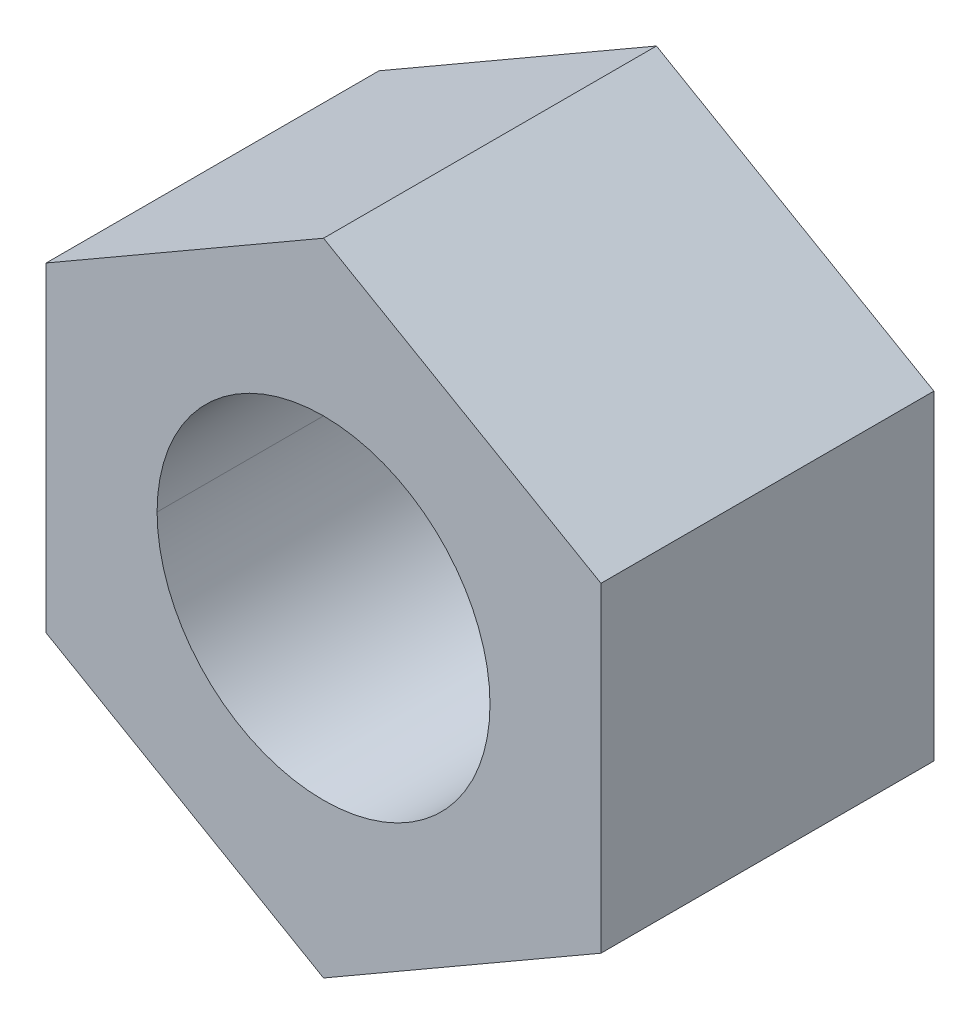
ISO-10303-21;
HEADER;
FILE_DESCRIPTION(('STEP AP214'),'2;1');
FILE_NAME('part.step','',(''),(''),'','','');
FILE_SCHEMA(('AUTOMOTIVE_DESIGN { 1 0 10303 214 1 1 1 1 }'));
ENDSEC;
DATA;
#1=APPLICATION_CONTEXT('core data for automotive mechanical design processes');
#2=APPLICATION_PROTOCOL_DEFINITION('international standard','automotive_design',2000,#1);
#3=PRODUCT_CONTEXT('',#1,'mechanical');
#4=PRODUCT('Part','Part','',(#3));
#5=PRODUCT_RELATED_PRODUCT_CATEGORY('part','',(#4));
#6=PRODUCT_DEFINITION_FORMATION('','',#4);
#7=PRODUCT_DEFINITION_CONTEXT('part definition',#1,'design');
#8=PRODUCT_DEFINITION('design','',#6,#7);
#9=PRODUCT_DEFINITION_SHAPE('','',#8);
#10=(LENGTH_UNIT() NAMED_UNIT(*) SI_UNIT(.MILLI.,.METRE.));
#11=(NAMED_UNIT(*) PLANE_ANGLE_UNIT() SI_UNIT($,.RADIAN.));
#12=(NAMED_UNIT(*) SI_UNIT($,.STERADIAN.) SOLID_ANGLE_UNIT());
#13=UNCERTAINTY_MEASURE_WITH_UNIT(LENGTH_MEASURE(1.E-05),#10,'distance_accuracy_value','');
#14=(GEOMETRIC_REPRESENTATION_CONTEXT(3) GLOBAL_UNCERTAINTY_ASSIGNED_CONTEXT((#13)) GLOBAL_UNIT_ASSIGNED_CONTEXT((#10,
#11,#12)) REPRESENTATION_CONTEXT('',''));
#15=CARTESIAN_POINT('',(0.,0.,0.));
#16=DIRECTION('',(0.,0.,1.));
#17=DIRECTION('',(1.,0.,0.));
#18=AXIS2_PLACEMENT_3D('',#15,#16,#17);
#19=CARTESIAN_POINT('',(1.9230769228327,-1.11028897906981,2.65615384631563));
#20=DIRECTION('',(1.,0.,0.));
#21=DIRECTION('',(0.,1.,0.));
#22=AXIS2_PLACEMENT_3D('',#19,#20,#21);
#23=PLANE('',#22);
#24=DIRECTION('',(0.,0.,1.));
#25=VECTOR('',#24,1.);
#26=CARTESIAN_POINT('',(1.9230769228327,-1.11028897906981,3.81000000001524));
#27=LINE('',#26,#25);
#28=CARTESIAN_POINT('',(1.9230769228327,-1.11028897906981,2.65615384631563));
#29=VERTEX_POINT('',#28);
#30=CARTESIAN_POINT('',(1.9230769228327,-1.11028897906981,4.96384615371486));
#31=VERTEX_POINT('',#30);
#32=EDGE_CURVE('E72',#29,#31,#27,.T.);
#33=ORIENTED_EDGE('',*,*,#32,.F.);
#34=DIRECTION('',(0.,1.,0.));
#35=VECTOR('',#34,1.);
#36=CARTESIAN_POINT('',(1.9230769228327,0.,2.65615384631563));
#37=LINE('',#36,#35);
#38=CARTESIAN_POINT('',(1.9230769228327,1.11028897906981,2.65615384631563));
#39=VERTEX_POINT('',#38);
#40=EDGE_CURVE('E11',#29,#39,#37,.T.);
#41=ORIENTED_EDGE('',*,*,#40,.T.);
#42=DIRECTION('',(0.,0.,1.));
#43=VECTOR('',#42,1.);
#44=CARTESIAN_POINT('',(1.9230769228327,1.11028897906981,3.81000000001524));
#45=LINE('',#44,#43);
#46=CARTESIAN_POINT('',(1.9230769228327,1.11028897906981,4.96384615371486));
#47=VERTEX_POINT('',#46);
#48=EDGE_CURVE('E59',#39,#47,#45,.T.);
#49=ORIENTED_EDGE('',*,*,#48,.T.);
#50=DIRECTION('',(0.,1.,0.));
#51=VECTOR('',#50,1.);
#52=CARTESIAN_POINT('',(1.9230769228327,0.,4.96384615371486));
#53=LINE('',#52,#51);
#54=EDGE_CURVE('E175',#31,#47,#53,.T.);
#55=ORIENTED_EDGE('',*,*,#54,.F.);
#56=EDGE_LOOP('',(#33,#41,#49,#55));
#57=FACE_BOUND('',#56,.T.);
#58=ADVANCED_FACE('F48',(#57),#23,.T.);
#59=CARTESIAN_POINT('',(1.9230769228327,1.11028897906982,2.65615384631563));
#60=DIRECTION('',(0.5,0.866025403784439,0.));
#61=DIRECTION('',(-0.866025403784439,0.5,0.));
#62=AXIS2_PLACEMENT_3D('',#59,#60,#61);
#63=PLANE('',#62);
#64=ORIENTED_EDGE('',*,*,#48,.F.);
#65=DIRECTION('',(-0.866025403784439,0.5,0.));
#66=VECTOR('',#65,1.);
#67=CARTESIAN_POINT('',(0.961538461416359,1.66543346860472,2.65615384631563));
#68=LINE('',#67,#66);
#69=CARTESIAN_POINT('',(0.,2.22057795813963,2.65615384631563));
#70=VERTEX_POINT('',#69);
#71=EDGE_CURVE('E202',#39,#70,#68,.T.);
#72=ORIENTED_EDGE('',*,*,#71,.T.);
#73=DIRECTION('',(0.,0.,1.));
#74=VECTOR('',#73,1.);
#75=CARTESIAN_POINT('',(0.,2.22057795813963,3.81000000001524));
#76=LINE('',#75,#74);
#77=CARTESIAN_POINT('',(0.,2.22057795813963,4.96384615371486));
#78=VERTEX_POINT('',#77);
#79=EDGE_CURVE('E203',#70,#78,#76,.T.);
#80=ORIENTED_EDGE('',*,*,#79,.T.);
#81=DIRECTION('',(-0.866025403784439,0.5,0.));
#82=VECTOR('',#81,1.);
#83=CARTESIAN_POINT('',(0.961538461416359,1.66543346860472,4.96384615371486));
#84=LINE('',#83,#82);
#85=EDGE_CURVE('E185',#47,#78,#84,.T.);
#86=ORIENTED_EDGE('',*,*,#85,.F.);
#87=EDGE_LOOP('',(#64,#72,#80,#86));
#88=FACE_BOUND('',#87,.T.);
#89=ADVANCED_FACE('F50',(#88),#63,.T.);
#90=CARTESIAN_POINT('',(0.,2.22057795813963,2.65615384631563));
#91=DIRECTION('',(-0.5,0.866025403784439,0.));
#92=DIRECTION('',(-0.866025403784439,-0.5,0.));
#93=AXIS2_PLACEMENT_3D('',#90,#91,#92);
#94=PLANE('',#93);
#95=ORIENTED_EDGE('',*,*,#79,.F.);
#96=DIRECTION('',(-0.866025403784439,-0.5,0.));
#97=VECTOR('',#96,1.);
#98=CARTESIAN_POINT('',(-0.961538461416336,1.66543346860472,2.65615384631563));
#99=LINE('',#98,#97);
#100=CARTESIAN_POINT('',(-1.92307692283268,1.11028897906982,2.65615384631563));
#101=VERTEX_POINT('',#100);
#102=EDGE_CURVE('E163',#70,#101,#99,.T.);
#103=ORIENTED_EDGE('',*,*,#102,.T.);
#104=DIRECTION('',(0.,0.,1.));
#105=VECTOR('',#104,1.);
#106=CARTESIAN_POINT('',(-1.92307692283268,1.11028897906982,3.81000000001524));
#107=LINE('',#106,#105);
#108=CARTESIAN_POINT('',(-1.92307692283268,1.11028897906982,4.96384615371486));
#109=VERTEX_POINT('',#108);
#110=EDGE_CURVE('E215',#101,#109,#107,.T.);
#111=ORIENTED_EDGE('',*,*,#110,.T.);
#112=DIRECTION('',(-0.866025403784439,-0.5,0.));
#113=VECTOR('',#112,1.);
#114=CARTESIAN_POINT('',(-0.961538461416336,1.66543346860472,4.96384615371486));
#115=LINE('',#114,#113);
#116=EDGE_CURVE('E189',#78,#109,#115,.T.);
#117=ORIENTED_EDGE('',*,*,#116,.F.);
#118=EDGE_LOOP('',(#95,#103,#111,#117));
#119=FACE_BOUND('',#118,.T.);
#120=ADVANCED_FACE('F250',(#119),#94,.T.);
#121=CARTESIAN_POINT('',(-1.92307692283268,1.11028897906982,2.65615384631563));
#122=DIRECTION('',(-1.,0.,0.));
#123=DIRECTION('',(0.,-1.,0.));
#124=AXIS2_PLACEMENT_3D('',#121,#122,#123);
#125=PLANE('',#124);
#126=ORIENTED_EDGE('',*,*,#110,.F.);
#127=DIRECTION('',(0.,-1.,0.));
#128=VECTOR('',#127,1.);
#129=CARTESIAN_POINT('',(-1.92307692283268,0.,2.65615384631563));
#130=LINE('',#129,#128);
#131=CARTESIAN_POINT('',(-1.92307692283268,-1.11028897906981,2.65615384631563));
#132=VERTEX_POINT('',#131);
#133=EDGE_CURVE('E171',#101,#132,#130,.T.);
#134=ORIENTED_EDGE('',*,*,#133,.T.);
#135=DIRECTION('',(0.,0.,1.));
#136=VECTOR('',#135,1.);
#137=CARTESIAN_POINT('',(-1.92307692283268,-1.11028897906981,3.81000000001524));
#138=LINE('',#137,#136);
#139=CARTESIAN_POINT('',(-1.92307692283268,-1.11028897906981,4.96384615371486));
#140=VERTEX_POINT('',#139);
#141=EDGE_CURVE('E167',#132,#140,#138,.T.);
#142=ORIENTED_EDGE('',*,*,#141,.T.);
#143=DIRECTION('',(0.,-1.,0.));
#144=VECTOR('',#143,1.);
#145=CARTESIAN_POINT('',(-1.92307692283268,0.,4.96384615371486));
#146=LINE('',#145,#144);
#147=EDGE_CURVE('E186',#109,#140,#146,.T.);
#148=ORIENTED_EDGE('',*,*,#147,.F.);
#149=EDGE_LOOP('',(#126,#134,#142,#148));
#150=FACE_BOUND('',#149,.T.);
#151=ADVANCED_FACE('F252',(#150),#125,.T.);
#152=CARTESIAN_POINT('',(-1.92307692283268,-1.11028897906981,2.65615384631563));
#153=DIRECTION('',(-0.5,-0.866025403784439,0.));
#154=DIRECTION('',(0.866025403784439,-0.5,0.));
#155=AXIS2_PLACEMENT_3D('',#152,#153,#154);
#156=PLANE('',#155);
#157=ORIENTED_EDGE('',*,*,#141,.F.);
#158=DIRECTION('',(0.866025403784439,-0.5,0.));
#159=VECTOR('',#158,1.);
#160=CARTESIAN_POINT('',(-0.961538461416338,-1.66543346860472,2.65615384631563));
#161=LINE('',#160,#159);
#162=CARTESIAN_POINT('',(0.,-2.22057795813963,2.65615384631563));
#163=VERTEX_POINT('',#162);
#164=EDGE_CURVE('E172',#132,#163,#161,.T.);
#165=ORIENTED_EDGE('',*,*,#164,.T.);
#166=DIRECTION('',(0.,0.,1.));
#167=VECTOR('',#166,1.);
#168=CARTESIAN_POINT('',(0.,-2.22057795813963,3.81000000001524));
#169=LINE('',#168,#167);
#170=CARTESIAN_POINT('',(0.,-2.22057795813963,4.96384615371486));
#171=VERTEX_POINT('',#170);
#172=EDGE_CURVE('E180',#163,#171,#169,.T.);
#173=ORIENTED_EDGE('',*,*,#172,.T.);
#174=DIRECTION('',(0.866025403784439,-0.5,0.));
#175=VECTOR('',#174,1.);
#176=CARTESIAN_POINT('',(-0.961538461416338,-1.66543346860472,4.96384615371486));
#177=LINE('',#176,#175);
#178=EDGE_CURVE('E190',#140,#171,#177,.T.);
#179=ORIENTED_EDGE('',*,*,#178,.F.);
#180=EDGE_LOOP('',(#157,#165,#173,#179));
#181=FACE_BOUND('',#180,.T.);
#182=ADVANCED_FACE('F255',(#181),#156,.T.);
#183=CARTESIAN_POINT('',(0.,-2.22057795813963,2.65615384631563));
#184=DIRECTION('',(0.5,-0.866025403784439,0.));
#185=DIRECTION('',(0.866025403784439,0.5,0.));
#186=AXIS2_PLACEMENT_3D('',#183,#184,#185);
#187=PLANE('',#186);
#188=ORIENTED_EDGE('',*,*,#172,.F.);
#189=DIRECTION('',(0.866025403784439,0.5,0.));
#190=VECTOR('',#189,1.);
#191=CARTESIAN_POINT('',(0.961538461416357,-1.66543346860472,2.65615384631563));
#192=LINE('',#191,#190);
#193=EDGE_CURVE('E166',#163,#29,#192,.T.);
#194=ORIENTED_EDGE('',*,*,#193,.T.);
#195=ORIENTED_EDGE('',*,*,#32,.T.);
#196=DIRECTION('',(0.866025403784439,0.5,0.));
#197=VECTOR('',#196,1.);
#198=CARTESIAN_POINT('',(0.961538461416357,-1.66543346860472,4.96384615371486));
#199=LINE('',#198,#197);
#200=EDGE_CURVE('E52',#171,#31,#199,.T.);
#201=ORIENTED_EDGE('',*,*,#200,.F.);
#202=EDGE_LOOP('',(#188,#194,#195,#201));
#203=FACE_BOUND('',#202,.T.);
#204=ADVANCED_FACE('F231',(#203),#187,.T.);
#205=CARTESIAN_POINT('',(0.,0.,3.81000000001524));
#206=DIRECTION('',(0.,0.,-1.));
#207=DIRECTION('',(1.,0.,0.));
#208=AXIS2_PLACEMENT_3D('',#205,#206,#207);
#209=CYLINDRICAL_SURFACE('',#208,1.15384615369962);
#210=CARTESIAN_POINT('',(0.,0.,4.96384615371486));
#211=DIRECTION('',(0.,0.,1.));
#212=DIRECTION('',(1.,0.,0.));
#213=AXIS2_PLACEMENT_3D('',#210,#211,#212);
#214=CIRCLE('',#213,1.15384615369962);
#215=CARTESIAN_POINT('',(-1.15384615369961,0.,4.96384615371486));
#216=VERTEX_POINT('',#215);
#217=CARTESIAN_POINT('',(1.15384615369962,0.,4.96384615371486));
#218=VERTEX_POINT('',#217);
#219=EDGE_CURVE('E146',#216,#218,#214,.T.);
#220=ORIENTED_EDGE('',*,*,#219,.T.);
#221=DIRECTION('',(0.,0.,1.));
#222=VECTOR('',#221,1.);
#223=CARTESIAN_POINT('',(1.15384615369962,0.,3.81000000001524));
#224=LINE('',#223,#222);
#225=CARTESIAN_POINT('',(1.15384615369962,0.,2.65615384631563));
#226=VERTEX_POINT('',#225);
#227=EDGE_CURVE('E132',#226,#218,#224,.T.);
#228=ORIENTED_EDGE('',*,*,#227,.F.);
#229=CARTESIAN_POINT('',(0.,0.,2.65615384631563));
#230=DIRECTION('',(0.,0.,1.));
#231=DIRECTION('',(1.,0.,0.));
#232=AXIS2_PLACEMENT_3D('',#229,#230,#231);
#233=CIRCLE('',#232,1.15384615369962);
#234=CARTESIAN_POINT('',(-1.15384615369961,0.,2.65615384631563));
#235=VERTEX_POINT('',#234);
#236=EDGE_CURVE('E173',#235,#226,#233,.T.);
#237=ORIENTED_EDGE('',*,*,#236,.F.);
#238=DIRECTION('',(0.,0.,1.));
#239=VECTOR('',#238,1.);
#240=CARTESIAN_POINT('',(-1.15384615369961,0.,3.81000000001524));
#241=LINE('',#240,#239);
#242=EDGE_CURVE('E149',#235,#216,#241,.T.);
#243=ORIENTED_EDGE('',*,*,#242,.T.);
#244=EDGE_LOOP('',(#220,#228,#237,#243));
#245=FACE_BOUND('',#244,.T.);
#246=ADVANCED_FACE('F148',(#245),#209,.F.);
#247=CARTESIAN_POINT('',(0.,0.,3.81000000001524));
#248=DIRECTION('',(0.,0.,-1.));
#249=DIRECTION('',(1.,0.,0.));
#250=AXIS2_PLACEMENT_3D('',#247,#248,#249);
#251=CYLINDRICAL_SURFACE('',#250,1.15384615369962);
#252=CARTESIAN_POINT('',(0.,0.,4.96384615371486));
#253=DIRECTION('',(0.,0.,1.));
#254=DIRECTION('',(1.,0.,0.));
#255=AXIS2_PLACEMENT_3D('',#252,#253,#254);
#256=CIRCLE('',#255,1.15384615369962);
#257=EDGE_CURVE('E138',#218,#216,#256,.T.);
#258=ORIENTED_EDGE('',*,*,#257,.T.);
#259=ORIENTED_EDGE('',*,*,#242,.F.);
#260=CARTESIAN_POINT('',(0.,0.,2.65615384631563));
#261=DIRECTION('',(0.,0.,1.));
#262=DIRECTION('',(1.,0.,0.));
#263=AXIS2_PLACEMENT_3D('',#260,#261,#262);
#264=CIRCLE('',#263,1.15384615369962);
#265=EDGE_CURVE('E140',#226,#235,#264,.T.);
#266=ORIENTED_EDGE('',*,*,#265,.F.);
#267=ORIENTED_EDGE('',*,*,#227,.T.);
#268=EDGE_LOOP('',(#258,#259,#266,#267));
#269=FACE_BOUND('',#268,.T.);
#270=ADVANCED_FACE('F135',(#269),#251,.F.);
#271=CARTESIAN_POINT('',(0.,0.,2.65615384631563));
#272=DIRECTION('',(0.,0.,1.));
#273=DIRECTION('',(1.,0.,0.));
#274=AXIS2_PLACEMENT_3D('',#271,#272,#273);
#275=PLANE('',#274);
#276=ORIENTED_EDGE('',*,*,#193,.F.);
#277=ORIENTED_EDGE('',*,*,#164,.F.);
#278=ORIENTED_EDGE('',*,*,#133,.F.);
#279=ORIENTED_EDGE('',*,*,#102,.F.);
#280=ORIENTED_EDGE('',*,*,#71,.F.);
#281=ORIENTED_EDGE('',*,*,#40,.F.);
#282=EDGE_LOOP('',(#276,#277,#278,#279,#280,#281));
#283=FACE_BOUND('',#282,.T.);
#284=ORIENTED_EDGE('',*,*,#265,.T.);
#285=ORIENTED_EDGE('',*,*,#236,.T.);
#286=EDGE_LOOP('',(#284,#285));
#287=FACE_BOUND('',#286,.T.);
#288=ADVANCED_FACE('F236',(#283,#287),#275,.F.);
#289=CARTESIAN_POINT('',(0.,0.,4.96384615371486));
#290=DIRECTION('',(0.,0.,1.));
#291=DIRECTION('',(1.,0.,0.));
#292=AXIS2_PLACEMENT_3D('',#289,#290,#291);
#293=PLANE('',#292);
#294=ORIENTED_EDGE('',*,*,#54,.T.);
#295=ORIENTED_EDGE('',*,*,#85,.T.);
#296=ORIENTED_EDGE('',*,*,#116,.T.);
#297=ORIENTED_EDGE('',*,*,#147,.T.);
#298=ORIENTED_EDGE('',*,*,#178,.T.);
#299=ORIENTED_EDGE('',*,*,#200,.T.);
#300=EDGE_LOOP('',(#294,#295,#296,#297,#298,#299));
#301=FACE_BOUND('',#300,.T.);
#302=ORIENTED_EDGE('',*,*,#219,.F.);
#303=ORIENTED_EDGE('',*,*,#257,.F.);
#304=EDGE_LOOP('',(#302,#303));
#305=FACE_BOUND('',#304,.T.);
#306=ADVANCED_FACE('F154',(#301,#305),#293,.T.);
#307=CLOSED_SHELL('',(#58,#89,#120,#151,#182,#204,#246,#270,#288,#306));
#308=MANIFOLD_SOLID_BREP('B2',#307);
#309=ADVANCED_BREP_SHAPE_REPRESENTATION('',(#18,#308),#14);
#310=SHAPE_DEFINITION_REPRESENTATION(#9,#309);
ENDSEC;
END-ISO-10303-21;
